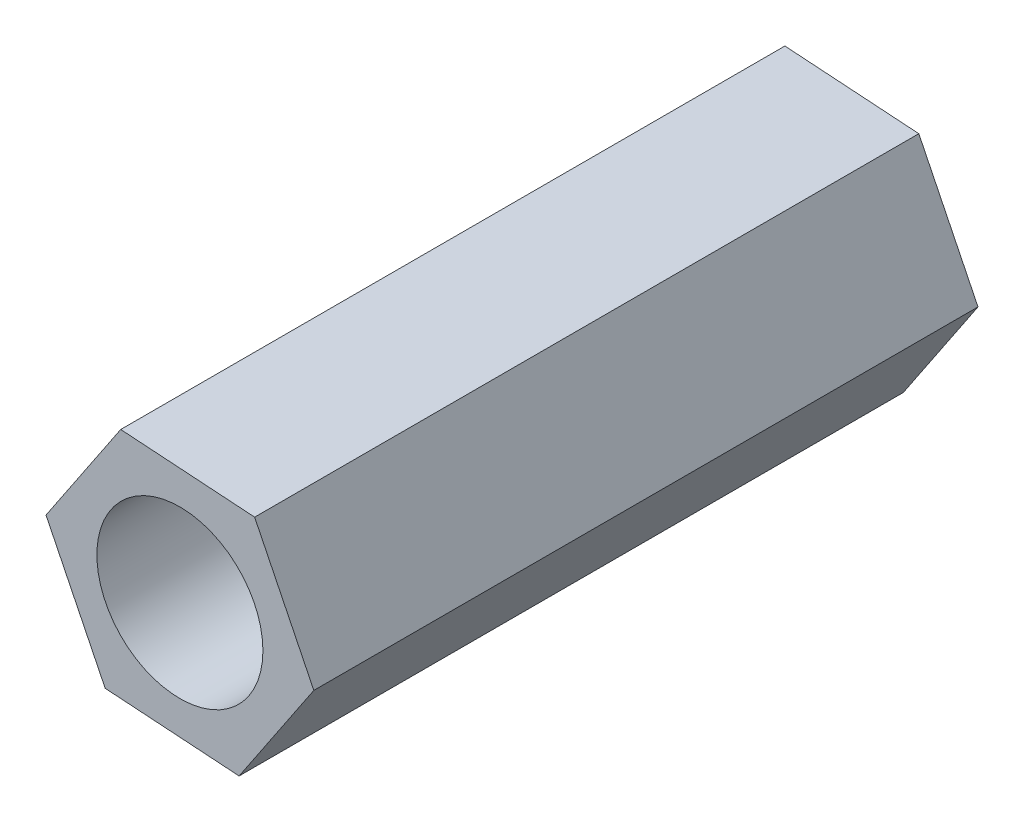
ISO-10303-21;
HEADER;
FILE_DESCRIPTION(('STEP AP214'),'2;1');
FILE_NAME('part.step','',(''),(''),'','','');
FILE_SCHEMA(('AUTOMOTIVE_DESIGN { 1 0 10303 214 1 1 1 1 }'));
ENDSEC;
DATA;
#1=APPLICATION_CONTEXT('core data for automotive mechanical design processes');
#2=APPLICATION_PROTOCOL_DEFINITION('international standard','automotive_design',2000,#1);
#3=PRODUCT_CONTEXT('',#1,'mechanical');
#4=PRODUCT('Part','Part','',(#3));
#5=PRODUCT_RELATED_PRODUCT_CATEGORY('part','',(#4));
#6=PRODUCT_DEFINITION_FORMATION('','',#4);
#7=PRODUCT_DEFINITION_CONTEXT('part definition',#1,'design');
#8=PRODUCT_DEFINITION('design','',#6,#7);
#9=PRODUCT_DEFINITION_SHAPE('','',#8);
#10=(LENGTH_UNIT() NAMED_UNIT(*) SI_UNIT(.MILLI.,.METRE.));
#11=(NAMED_UNIT(*) PLANE_ANGLE_UNIT() SI_UNIT($,.RADIAN.));
#12=(NAMED_UNIT(*) SI_UNIT($,.STERADIAN.) SOLID_ANGLE_UNIT());
#13=UNCERTAINTY_MEASURE_WITH_UNIT(LENGTH_MEASURE(1.E-05),#10,'distance_accuracy_value','');
#14=(GEOMETRIC_REPRESENTATION_CONTEXT(3) GLOBAL_UNCERTAINTY_ASSIGNED_CONTEXT((#13)) GLOBAL_UNIT_ASSIGNED_CONTEXT((#10,
#11,#12)) REPRESENTATION_CONTEXT('',''));
#15=CARTESIAN_POINT('',(0.,0.,0.));
#16=DIRECTION('',(0.,0.,1.));
#17=DIRECTION('',(1.,0.,0.));
#18=AXIS2_PLACEMENT_3D('',#15,#16,#17);
#19=CARTESIAN_POINT('',(0.,0.,20.));
#20=DIRECTION('',(0.,0.,1.));
#21=DIRECTION('',(1.,0.,0.));
#22=AXIS2_PLACEMENT_3D('',#19,#20,#21);
#23=PLANE('',#22);
#24=DIRECTION('',(0.997764936241488,-0.0668216432529155,0.));
#25=VECTOR('',#24,1.);
#26=CARTESIAN_POINT('',(-2.25008524222968,-3.35714904882603,20.));
#27=LINE('',#26,#25);
#28=CARTESIAN_POINT('',(-2.25008524222968,-3.35714904882603,20.));
#29=VERTEX_POINT('',#28);
#30=CARTESIAN_POINT('',(1.78233373945927,-3.62720550486438,20.));
#31=VERTEX_POINT('',#30);
#32=EDGE_CURVE('E131',#29,#31,#27,.T.);
#33=ORIENTED_EDGE('',*,*,#32,.T.);
#34=DIRECTION('',(0.556751708700389,0.830678960164032,0.));
#35=VECTOR('',#34,1.);
#36=CARTESIAN_POINT('',(1.78233373945927,-3.62720550486438,20.));
#37=LINE('',#36,#35);
#38=CARTESIAN_POINT('',(4.03241898168895,-0.270056456038346,20.));
#39=VERTEX_POINT('',#38);
#40=EDGE_CURVE('E89',#31,#39,#37,.T.);
#41=ORIENTED_EDGE('',*,*,#40,.T.);
#42=DIRECTION('',(-0.441013227541098,0.897500603416947,0.));
#43=VECTOR('',#42,1.);
#44=CARTESIAN_POINT('',(4.03241898168895,-0.270056456038346,20.));
#45=LINE('',#44,#43);
#46=CARTESIAN_POINT('',(2.25008524222968,3.35714904882604,20.));
#47=VERTEX_POINT('',#46);
#48=EDGE_CURVE('E102',#39,#47,#45,.T.);
#49=ORIENTED_EDGE('',*,*,#48,.T.);
#50=DIRECTION('',(-0.997764936241488,0.0668216432529155,0.));
#51=VECTOR('',#50,1.);
#52=CARTESIAN_POINT('',(2.25008524222968,3.35714904882604,20.));
#53=LINE('',#52,#51);
#54=CARTESIAN_POINT('',(-1.78233373945927,3.62720550486438,20.));
#55=VERTEX_POINT('',#54);
#56=EDGE_CURVE('E96',#47,#55,#53,.T.);
#57=ORIENTED_EDGE('',*,*,#56,.T.);
#58=DIRECTION('',(-0.556751708700389,-0.830678960164032,0.));
#59=VECTOR('',#58,1.);
#60=CARTESIAN_POINT('',(-1.78233373945927,3.62720550486438,20.));
#61=LINE('',#60,#59);
#62=CARTESIAN_POINT('',(-4.03241898168895,0.270056456038347,20.));
#63=VERTEX_POINT('',#62);
#64=EDGE_CURVE('E100',#55,#63,#61,.T.);
#65=ORIENTED_EDGE('',*,*,#64,.T.);
#66=DIRECTION('',(0.441013227541098,-0.897500603416947,0.));
#67=VECTOR('',#66,1.);
#68=CARTESIAN_POINT('',(-4.03241898168895,0.270056456038347,20.));
#69=LINE('',#68,#67);
#70=EDGE_CURVE('E52',#63,#29,#69,.T.);
#71=ORIENTED_EDGE('',*,*,#70,.T.);
#72=EDGE_LOOP('',(#33,#41,#49,#57,#65,#71));
#73=FACE_BOUND('',#72,.T.);
#74=CARTESIAN_POINT('',(0.,0.,20.));
#75=DIRECTION('',(0.,0.,1.));
#76=DIRECTION('',(1.,0.,0.));
#77=AXIS2_PLACEMENT_3D('',#74,#75,#76);
#78=CIRCLE('',#77,2.5);
#79=CARTESIAN_POINT('',(2.5,0.,20.));
#80=VERTEX_POINT('',#79);
#81=EDGE_CURVE('E124',#80,#80,#78,.T.);
#82=ORIENTED_EDGE('',*,*,#81,.F.);
#83=EDGE_LOOP('',(#82));
#84=FACE_BOUND('',#83,.T.);
#85=ADVANCED_FACE('F35',(#73,#84),#23,.T.);
#86=CARTESIAN_POINT('',(0.,0.,0.));
#87=DIRECTION('',(0.,0.,1.));
#88=DIRECTION('',(1.,0.,0.));
#89=AXIS2_PLACEMENT_3D('',#86,#87,#88);
#90=PLANE('',#89);
#91=DIRECTION('',(0.997764936241488,-0.0668216432529155,0.));
#92=VECTOR('',#91,1.);
#93=CARTESIAN_POINT('',(-2.25008524222968,-3.35714904882603,0.));
#94=LINE('',#93,#92);
#95=CARTESIAN_POINT('',(-2.25008524222968,-3.35714904882603,0.));
#96=VERTEX_POINT('',#95);
#97=CARTESIAN_POINT('',(1.78233373945927,-3.62720550486438,0.));
#98=VERTEX_POINT('',#97);
#99=EDGE_CURVE('E120',#96,#98,#94,.T.);
#100=ORIENTED_EDGE('',*,*,#99,.F.);
#101=DIRECTION('',(0.441013227541098,-0.897500603416947,0.));
#102=VECTOR('',#101,1.);
#103=CARTESIAN_POINT('',(-4.03241898168895,0.270056456038347,0.));
#104=LINE('',#103,#102);
#105=CARTESIAN_POINT('',(-4.03241898168895,0.270056456038347,0.));
#106=VERTEX_POINT('',#105);
#107=EDGE_CURVE('E81',#106,#96,#104,.T.);
#108=ORIENTED_EDGE('',*,*,#107,.F.);
#109=DIRECTION('',(-0.556751708700389,-0.830678960164032,0.));
#110=VECTOR('',#109,1.);
#111=CARTESIAN_POINT('',(-1.78233373945927,3.62720550486438,0.));
#112=LINE('',#111,#110);
#113=CARTESIAN_POINT('',(-1.78233373945927,3.62720550486438,0.));
#114=VERTEX_POINT('',#113);
#115=EDGE_CURVE('E75',#114,#106,#112,.T.);
#116=ORIENTED_EDGE('',*,*,#115,.F.);
#117=DIRECTION('',(-0.997764936241488,0.0668216432529155,0.));
#118=VECTOR('',#117,1.);
#119=CARTESIAN_POINT('',(2.25008524222968,3.35714904882604,0.));
#120=LINE('',#119,#118);
#121=CARTESIAN_POINT('',(2.25008524222968,3.35714904882604,0.));
#122=VERTEX_POINT('',#121);
#123=EDGE_CURVE('E110',#122,#114,#120,.T.);
#124=ORIENTED_EDGE('',*,*,#123,.F.);
#125=DIRECTION('',(-0.441013227541098,0.897500603416947,0.));
#126=VECTOR('',#125,1.);
#127=CARTESIAN_POINT('',(4.03241898168895,-0.270056456038346,0.));
#128=LINE('',#127,#126);
#129=CARTESIAN_POINT('',(4.03241898168895,-0.270056456038346,0.));
#130=VERTEX_POINT('',#129);
#131=EDGE_CURVE('E126',#130,#122,#128,.T.);
#132=ORIENTED_EDGE('',*,*,#131,.F.);
#133=DIRECTION('',(0.556751708700389,0.830678960164032,0.));
#134=VECTOR('',#133,1.);
#135=CARTESIAN_POINT('',(1.78233373945927,-3.62720550486438,0.));
#136=LINE('',#135,#134);
#137=EDGE_CURVE('E123',#98,#130,#136,.T.);
#138=ORIENTED_EDGE('',*,*,#137,.F.);
#139=EDGE_LOOP('',(#100,#108,#116,#124,#132,#138));
#140=FACE_BOUND('',#139,.T.);
#141=CARTESIAN_POINT('',(0.,0.,0.));
#142=DIRECTION('',(0.,0.,1.));
#143=DIRECTION('',(1.,0.,0.));
#144=AXIS2_PLACEMENT_3D('',#141,#142,#143);
#145=CIRCLE('',#144,2.5);
#146=CARTESIAN_POINT('',(2.5,0.,0.));
#147=VERTEX_POINT('',#146);
#148=EDGE_CURVE('E224',#147,#147,#145,.T.);
#149=ORIENTED_EDGE('',*,*,#148,.T.);
#150=EDGE_LOOP('',(#149));
#151=FACE_BOUND('',#150,.T.);
#152=ADVANCED_FACE('F140',(#140,#151),#90,.F.);
#153=CARTESIAN_POINT('',(-2.25008524222968,-3.35714904882603,20.));
#154=DIRECTION('',(0.0668216432529155,0.997764936241488,0.));
#155=DIRECTION('',(-0.997764936241488,0.0668216432529155,0.));
#156=AXIS2_PLACEMENT_3D('',#153,#154,#155);
#157=PLANE('',#156);
#158=ORIENTED_EDGE('',*,*,#99,.T.);
#159=DIRECTION('',(0.,0.,-1.));
#160=VECTOR('',#159,1.);
#161=CARTESIAN_POINT('',(1.78233373945927,-3.62720550486438,20.));
#162=LINE('',#161,#160);
#163=EDGE_CURVE('E11',#31,#98,#162,.T.);
#164=ORIENTED_EDGE('',*,*,#163,.F.);
#165=ORIENTED_EDGE('',*,*,#32,.F.);
#166=DIRECTION('',(0.,0.,-1.));
#167=VECTOR('',#166,1.);
#168=CARTESIAN_POINT('',(-2.25008524222968,-3.35714904882603,20.));
#169=LINE('',#168,#167);
#170=EDGE_CURVE('E116',#29,#96,#169,.T.);
#171=ORIENTED_EDGE('',*,*,#170,.T.);
#172=EDGE_LOOP('',(#158,#164,#165,#171));
#173=FACE_BOUND('',#172,.T.);
#174=ADVANCED_FACE('F37',(#173),#157,.F.);
#175=CARTESIAN_POINT('',(1.78233373945927,-3.62720550486438,20.));
#176=DIRECTION('',(-0.830678960164032,0.556751708700389,0.));
#177=DIRECTION('',(-0.556751708700389,-0.830678960164032,0.));
#178=AXIS2_PLACEMENT_3D('',#175,#176,#177);
#179=PLANE('',#178);
#180=ORIENTED_EDGE('',*,*,#137,.T.);
#181=DIRECTION('',(0.,0.,-1.));
#182=VECTOR('',#181,1.);
#183=CARTESIAN_POINT('',(4.03241898168895,-0.270056456038346,20.));
#184=LINE('',#183,#182);
#185=EDGE_CURVE('E44',#39,#130,#184,.T.);
#186=ORIENTED_EDGE('',*,*,#185,.F.);
#187=ORIENTED_EDGE('',*,*,#40,.F.);
#188=ORIENTED_EDGE('',*,*,#163,.T.);
#189=EDGE_LOOP('',(#180,#186,#187,#188));
#190=FACE_BOUND('',#189,.T.);
#191=ADVANCED_FACE('F165',(#190),#179,.F.);
#192=CARTESIAN_POINT('',(4.03241898168895,-0.270056456038346,20.));
#193=DIRECTION('',(-0.897500603416947,-0.441013227541098,0.));
#194=DIRECTION('',(0.441013227541098,-0.897500603416947,0.));
#195=AXIS2_PLACEMENT_3D('',#192,#193,#194);
#196=PLANE('',#195);
#197=ORIENTED_EDGE('',*,*,#131,.T.);
#198=DIRECTION('',(0.,0.,-1.));
#199=VECTOR('',#198,1.);
#200=CARTESIAN_POINT('',(2.25008524222968,3.35714904882604,20.));
#201=LINE('',#200,#199);
#202=EDGE_CURVE('E111',#47,#122,#201,.T.);
#203=ORIENTED_EDGE('',*,*,#202,.F.);
#204=ORIENTED_EDGE('',*,*,#48,.F.);
#205=ORIENTED_EDGE('',*,*,#185,.T.);
#206=EDGE_LOOP('',(#197,#203,#204,#205));
#207=FACE_BOUND('',#206,.T.);
#208=ADVANCED_FACE('F137',(#207),#196,.F.);
#209=CARTESIAN_POINT('',(2.25008524222968,3.35714904882604,20.));
#210=DIRECTION('',(-0.0668216432529154,-0.997764936241488,0.));
#211=DIRECTION('',(0.997764936241488,-0.0668216432529154,0.));
#212=AXIS2_PLACEMENT_3D('',#209,#210,#211);
#213=PLANE('',#212);
#214=ORIENTED_EDGE('',*,*,#123,.T.);
#215=DIRECTION('',(0.,0.,-1.));
#216=VECTOR('',#215,1.);
#217=CARTESIAN_POINT('',(-1.78233373945927,3.62720550486438,20.));
#218=LINE('',#217,#216);
#219=EDGE_CURVE('E107',#55,#114,#218,.T.);
#220=ORIENTED_EDGE('',*,*,#219,.F.);
#221=ORIENTED_EDGE('',*,*,#56,.F.);
#222=ORIENTED_EDGE('',*,*,#202,.T.);
#223=EDGE_LOOP('',(#214,#220,#221,#222));
#224=FACE_BOUND('',#223,.T.);
#225=ADVANCED_FACE('F108',(#224),#213,.F.);
#226=CARTESIAN_POINT('',(-1.78233373945927,3.62720550486438,20.));
#227=DIRECTION('',(0.830678960164032,-0.556751708700389,0.));
#228=DIRECTION('',(0.556751708700389,0.830678960164032,0.));
#229=AXIS2_PLACEMENT_3D('',#226,#227,#228);
#230=PLANE('',#229);
#231=ORIENTED_EDGE('',*,*,#115,.T.);
#232=DIRECTION('',(0.,0.,-1.));
#233=VECTOR('',#232,1.);
#234=CARTESIAN_POINT('',(-4.03241898168895,0.270056456038347,20.));
#235=LINE('',#234,#233);
#236=EDGE_CURVE('E112',#63,#106,#235,.T.);
#237=ORIENTED_EDGE('',*,*,#236,.F.);
#238=ORIENTED_EDGE('',*,*,#64,.F.);
#239=ORIENTED_EDGE('',*,*,#219,.T.);
#240=EDGE_LOOP('',(#231,#237,#238,#239));
#241=FACE_BOUND('',#240,.T.);
#242=ADVANCED_FACE('F114',(#241),#230,.F.);
#243=CARTESIAN_POINT('',(-4.03241898168895,0.270056456038347,20.));
#244=DIRECTION('',(0.897500603416947,0.441013227541098,0.));
#245=DIRECTION('',(-0.441013227541098,0.897500603416947,0.));
#246=AXIS2_PLACEMENT_3D('',#243,#244,#245);
#247=PLANE('',#246);
#248=ORIENTED_EDGE('',*,*,#107,.T.);
#249=ORIENTED_EDGE('',*,*,#170,.F.);
#250=ORIENTED_EDGE('',*,*,#70,.F.);
#251=ORIENTED_EDGE('',*,*,#236,.T.);
#252=EDGE_LOOP('',(#248,#249,#250,#251));
#253=FACE_BOUND('',#252,.T.);
#254=ADVANCED_FACE('F145',(#253),#247,.F.);
#255=CARTESIAN_POINT('',(0.,0.,20.));
#256=DIRECTION('',(0.,0.,-1.));
#257=DIRECTION('',(-1.,0.,0.));
#258=AXIS2_PLACEMENT_3D('',#255,#256,#257);
#259=CYLINDRICAL_SURFACE('',#258,2.5);
#260=ORIENTED_EDGE('',*,*,#81,.T.);
#261=EDGE_LOOP('',(#260));
#262=FACE_BOUND('',#261,.T.);
#263=ORIENTED_EDGE('',*,*,#148,.F.);
#264=EDGE_LOOP('',(#263));
#265=FACE_BOUND('',#264,.T.);
#266=ADVANCED_FACE('F147',(#262,#265),#259,.F.);
#267=CLOSED_SHELL('',(#85,#152,#174,#191,#208,#225,#242,#254,#266));
#268=MANIFOLD_SOLID_BREP('B2',#267);
#269=ADVANCED_BREP_SHAPE_REPRESENTATION('',(#18,#268),#14);
#270=SHAPE_DEFINITION_REPRESENTATION(#9,#269);
ENDSEC;
END-ISO-10303-21;
